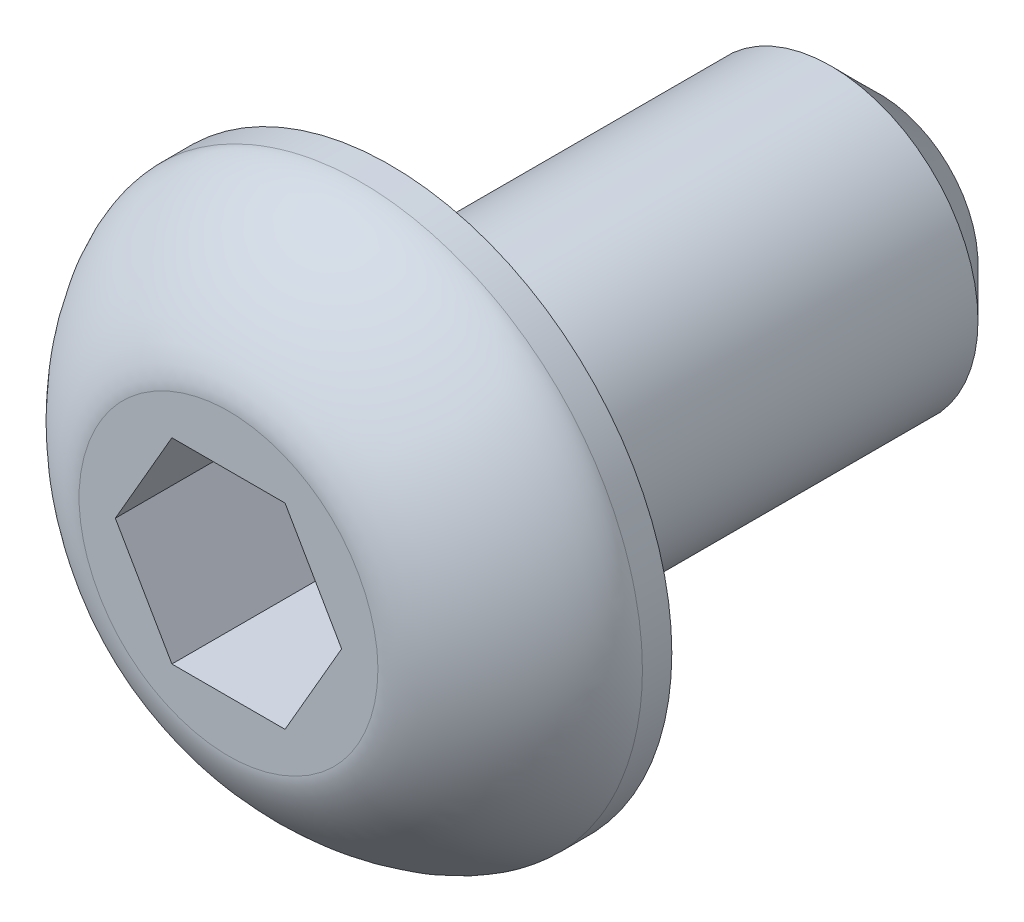
ISO-10303-21;
HEADER;
FILE_DESCRIPTION(('STEP AP214'),'2;1');
FILE_NAME('part.step','',(''),(''),'','','');
FILE_SCHEMA(('AUTOMOTIVE_DESIGN { 1 0 10303 214 1 1 1 1 }'));
ENDSEC;
DATA;
#1=APPLICATION_CONTEXT('core data for automotive mechanical design processes');
#2=APPLICATION_PROTOCOL_DEFINITION('international standard','automotive_design',2000,#1);
#3=PRODUCT_CONTEXT('',#1,'mechanical');
#4=PRODUCT('Part','Part','',(#3));
#5=PRODUCT_RELATED_PRODUCT_CATEGORY('part','',(#4));
#6=PRODUCT_DEFINITION_FORMATION('','',#4);
#7=PRODUCT_DEFINITION_CONTEXT('part definition',#1,'design');
#8=PRODUCT_DEFINITION('design','',#6,#7);
#9=PRODUCT_DEFINITION_SHAPE('','',#8);
#10=(LENGTH_UNIT() NAMED_UNIT(*) SI_UNIT(.MILLI.,.METRE.));
#11=(NAMED_UNIT(*) PLANE_ANGLE_UNIT() SI_UNIT($,.RADIAN.));
#12=(NAMED_UNIT(*) SI_UNIT($,.STERADIAN.) SOLID_ANGLE_UNIT());
#13=UNCERTAINTY_MEASURE_WITH_UNIT(LENGTH_MEASURE(1.E-05),#10,'distance_accuracy_value','');
#14=(GEOMETRIC_REPRESENTATION_CONTEXT(3) GLOBAL_UNCERTAINTY_ASSIGNED_CONTEXT((#13)) GLOBAL_UNIT_ASSIGNED_CONTEXT((#10,
#11,#12)) REPRESENTATION_CONTEXT('',''));
#15=CARTESIAN_POINT('',(0.,0.,0.));
#16=DIRECTION('',(0.,0.,1.));
#17=DIRECTION('',(1.,0.,0.));
#18=AXIS2_PLACEMENT_3D('',#15,#16,#17);
#19=CARTESIAN_POINT('',(0.,0.,1.65));
#20=DIRECTION('',(0.,0.,1.));
#21=DIRECTION('',(1.,0.,0.));
#22=AXIS2_PLACEMENT_3D('',#19,#20,#21);
#23=PLANE('',#22);
#24=CARTESIAN_POINT('',(1.525,0.,1.65));
#25=CARTESIAN_POINT('',(1.525,-0.399244037781713,1.65));
#26=CARTESIAN_POINT('',(1.36064600777329,-0.796029674845719,1.65));
#27=CARTESIAN_POINT('',(0.79602967484567,-1.36064600777326,1.65));
#28=CARTESIAN_POINT('',(0.399244037781751,-1.525,1.65));
#29=CARTESIAN_POINT('',(-0.399244037781746,-1.525,1.65));
#30=CARTESIAN_POINT('',(-0.79602967484569,-1.36064600777324,1.65));
#31=CARTESIAN_POINT('',(-1.36064600777328,-0.796029674845735,1.65));
#32=CARTESIAN_POINT('',(-1.525,-0.399244037781749,1.65));
#33=CARTESIAN_POINT('',(-1.525,0.399244037781749,1.65));
#34=CARTESIAN_POINT('',(-1.36064600777328,0.79602967484569,1.65));
#35=CARTESIAN_POINT('',(-0.796029674845692,1.36064600777328,1.65));
#36=CARTESIAN_POINT('',(-0.399244037781749,1.525,1.65));
#37=CARTESIAN_POINT('',(0.399244037781749,1.525,1.65));
#38=CARTESIAN_POINT('',(0.79602967484573,1.36064600777328,1.65));
#39=CARTESIAN_POINT('',(1.36064600777324,0.796029674845687,1.65));
#40=CARTESIAN_POINT('',(1.525,0.399244037781713,1.65));
#41=CARTESIAN_POINT('',(1.525,0.,1.65));
#42=(BOUNDED_CURVE() B_SPLINE_CURVE(3,(#24,#25,#26,#27,#28,#29,#30,#31,#32,#33,#34,#35,#36,#37,
#38,#39,#40,#41),.UNSPECIFIED.,.T.,.F.) B_SPLINE_CURVE_WITH_KNOTS((4,2,2,2,2,2,2,2,4),(0.,
0.785398163397451,1.5707963267949,2.35619449019235,3.1415926535898,3.92699081698725,
4.7123889803847,5.49778714378214,6.28318530717959),
.UNSPECIFIED.) CURVE() GEOMETRIC_REPRESENTATION_ITEM() RATIONAL_B_SPLINE_CURVE((1.,1.,1.,1.,1.,
1.,1.,1.,1.,1.,1.,1.,1.,1.,1.,1.,1.,1.)) REPRESENTATION_ITEM(''));
#43=CARTESIAN_POINT('',(1.525,0.,1.65));
#44=VERTEX_POINT('',#43);
#45=EDGE_CURVE('E153',#44,#44,#42,.F.);
#46=ORIENTED_EDGE('',*,*,#45,.T.);
#47=EDGE_LOOP('',(#46));
#48=FACE_BOUND('',#47,.T.);
#49=DIRECTION('',(1.,0.,0.));
#50=VECTOR('',#49,1.);
#51=CARTESIAN_POINT('',(0.0995927494460478,1.,1.65));
#52=LINE('',#51,#50);
#53=CARTESIAN_POINT('',(-0.577350269189625,1.,1.65));
#54=VERTEX_POINT('',#53);
#55=CARTESIAN_POINT('',(0.577350269189627,1.,1.65));
#56=VERTEX_POINT('',#55);
#57=EDGE_CURVE('E132',#54,#56,#52,.T.);
#58=ORIENTED_EDGE('',*,*,#57,.T.);
#59=DIRECTION('',(0.5,-0.866025403784439,0.));
#60=VECTOR('',#59,1.);
#61=CARTESIAN_POINT('',(0.915821778507463,0.413750148946983,1.65));
#62=LINE('',#61,#60);
#63=CARTESIAN_POINT('',(1.15470053837925,0.,1.65));
#64=VERTEX_POINT('',#63);
#65=EDGE_CURVE('E129',#56,#64,#62,.T.);
#66=ORIENTED_EDGE('',*,*,#65,.T.);
#67=DIRECTION('',(-0.5,-0.866025403784438,0.));
#68=VECTOR('',#67,1.);
#69=CARTESIAN_POINT('',(0.816229029061414,-0.586249851053017,1.65));
#70=LINE('',#69,#68);
#71=CARTESIAN_POINT('',(0.577350269189625,-1.,1.65));
#72=VERTEX_POINT('',#71);
#73=EDGE_CURVE('E140',#64,#72,#70,.T.);
#74=ORIENTED_EDGE('',*,*,#73,.T.);
#75=DIRECTION('',(-1.,0.,0.));
#76=VECTOR('',#75,1.);
#77=CARTESIAN_POINT('',(-0.0995927494460486,-1.,1.65));
#78=LINE('',#77,#76);
#79=CARTESIAN_POINT('',(-0.577350269189626,-1.,1.65));
#80=VERTEX_POINT('',#79);
#81=EDGE_CURVE('E59',#72,#80,#78,.T.);
#82=ORIENTED_EDGE('',*,*,#81,.T.);
#83=DIRECTION('',(-0.5,0.866025403784439,0.));
#84=VECTOR('',#83,1.);
#85=CARTESIAN_POINT('',(-0.866025403784439,-0.5,1.65));
#86=LINE('',#85,#84);
#87=CARTESIAN_POINT('',(-1.15470053837925,0.,1.65));
#88=VERTEX_POINT('',#87);
#89=EDGE_CURVE('E108',#80,#88,#86,.T.);
#90=ORIENTED_EDGE('',*,*,#89,.T.);
#91=DIRECTION('',(0.5,0.866025403784439,0.));
#92=VECTOR('',#91,1.);
#93=CARTESIAN_POINT('',(-0.816229029061414,0.586249851053016,1.65));
#94=LINE('',#93,#92);
#95=EDGE_CURVE('E135',#88,#54,#94,.T.);
#96=ORIENTED_EDGE('',*,*,#95,.T.);
#97=EDGE_LOOP('',(#58,#66,#74,#82,#90,#96));
#98=FACE_BOUND('',#97,.T.);
#99=ADVANCED_FACE('F44',(#48,#98),#23,.T.);
#100=CARTESIAN_POINT('',(0.,0.,1.65));
#101=DIRECTION('',(0.,0.,-1.));
#102=DIRECTION('',(-1.,0.,0.));
#103=AXIS2_PLACEMENT_3D('',#100,#101,#102);
#104=CYLINDRICAL_SURFACE('',#103,2.875);
#105=CARTESIAN_POINT('',(2.875,0.,0.3));
#106=CARTESIAN_POINT('',(2.875,0.752673185981918,0.3));
#107=CARTESIAN_POINT('',(2.56515230973648,1.50071168208618,0.3));
#108=CARTESIAN_POINT('',(1.50071168208618,2.56515230973648,0.3));
#109=CARTESIAN_POINT('',(0.752673185981985,2.875,0.3));
#110=CARTESIAN_POINT('',(-0.752673185981985,2.875,0.3));
#111=CARTESIAN_POINT('',(-1.50071168208614,2.56515230973651,0.3));
#112=CARTESIAN_POINT('',(-2.56515230973651,1.50071168208614,0.3));
#113=CARTESIAN_POINT('',(-2.875,0.752673185981986,0.3));
#114=CARTESIAN_POINT('',(-2.875,-0.752673185981985,0.3));
#115=CARTESIAN_POINT('',(-2.56515230973647,-1.50071168208618,0.3));
#116=CARTESIAN_POINT('',(-1.50071168208618,-2.56515230973647,0.3));
#117=CARTESIAN_POINT('',(-0.752673185981981,-2.875,0.3));
#118=CARTESIAN_POINT('',(0.75267318598199,-2.875,0.3));
#119=CARTESIAN_POINT('',(1.50071168208611,-2.56515230973653,0.3));
#120=CARTESIAN_POINT('',(2.56515230973652,-1.50071168208613,0.3));
#121=CARTESIAN_POINT('',(2.875,-0.752673185981918,0.3));
#122=CARTESIAN_POINT('',(2.875,0.,0.3));
#123=(BOUNDED_CURVE() B_SPLINE_CURVE(3,(#105,#106,#107,#108,#109,#110,#111,#112,#113,#114,#115,
#116,#117,#118,#119,#120,#121,#122),.UNSPECIFIED.,.T.,.F.) B_SPLINE_CURVE_WITH_KNOTS((4,2,2,2,2,
2,2,2,4),(0.,0.785398163397448,1.5707963267949,2.35619449019234,3.1415926535898,
3.92699081698724,4.71238898038469,5.49778714378214,6.28318530717959),
.UNSPECIFIED.) CURVE() GEOMETRIC_REPRESENTATION_ITEM() RATIONAL_B_SPLINE_CURVE((1.,1.,1.,1.,1.,
1.,1.,1.,1.,1.,1.,1.,1.,1.,1.,1.,1.,1.)) REPRESENTATION_ITEM(''));
#124=CARTESIAN_POINT('',(2.875,0.,0.3));
#125=VERTEX_POINT('',#124);
#126=EDGE_CURVE('E210',#125,#125,#123,.F.);
#127=ORIENTED_EDGE('',*,*,#126,.T.);
#128=EDGE_LOOP('',(#127));
#129=FACE_BOUND('',#128,.T.);
#130=CARTESIAN_POINT('',(0.,0.,0.));
#131=DIRECTION('',(0.,0.,1.));
#132=DIRECTION('',(1.,0.,0.));
#133=AXIS2_PLACEMENT_3D('',#130,#131,#132);
#134=CIRCLE('',#133,2.875);
#135=CARTESIAN_POINT('',(2.875,0.,0.));
#136=VERTEX_POINT('',#135);
#137=EDGE_CURVE('E150',#136,#136,#134,.T.);
#138=ORIENTED_EDGE('',*,*,#137,.T.);
#139=EDGE_LOOP('',(#138));
#140=FACE_BOUND('',#139,.T.);
#141=ADVANCED_FACE('F173',(#129,#140),#104,.T.);
#142=CARTESIAN_POINT('',(0.,0.,0.));
#143=DIRECTION('',(0.,0.,1.));
#144=DIRECTION('',(1.,0.,0.));
#145=AXIS2_PLACEMENT_3D('',#142,#143,#144);
#146=PLANE('',#145);
#147=CARTESIAN_POINT('',(0.,0.,0.));
#148=DIRECTION('',(0.,0.,-1.));
#149=DIRECTION('',(1.,0.,0.));
#150=AXIS2_PLACEMENT_3D('',#147,#148,#149);
#151=CIRCLE('',#150,1.5);
#152=CARTESIAN_POINT('',(1.5,0.,0.));
#153=VERTEX_POINT('',#152);
#154=EDGE_CURVE('E219',#153,#153,#151,.T.);
#155=ORIENTED_EDGE('',*,*,#154,.F.);
#156=EDGE_LOOP('',(#155));
#157=FACE_BOUND('',#156,.T.);
#158=ORIENTED_EDGE('',*,*,#137,.F.);
#159=EDGE_LOOP('',(#158));
#160=FACE_BOUND('',#159,.T.);
#161=ADVANCED_FACE('F176',(#157,#160),#146,.F.);
#162=CARTESIAN_POINT('',(0.915821778507463,0.413750148946983,0.15));
#163=DIRECTION('',(-0.866025403784439,-0.5,0.));
#164=DIRECTION('',(0.5,-0.866025403784439,0.));
#165=AXIS2_PLACEMENT_3D('',#162,#163,#164);
#166=PLANE('',#165);
#167=ORIENTED_EDGE('',*,*,#65,.F.);
#168=DIRECTION('',(0.,0.,1.));
#169=VECTOR('',#168,1.);
#170=CARTESIAN_POINT('',(0.577350269189627,1.,0.15));
#171=LINE('',#170,#169);
#172=CARTESIAN_POINT('',(0.577350269189627,1.,0.15));
#173=VERTEX_POINT('',#172);
#174=EDGE_CURVE('E92',#173,#56,#171,.T.);
#175=ORIENTED_EDGE('',*,*,#174,.F.);
#176=DIRECTION('',(0.5,-0.866025403784439,0.));
#177=VECTOR('',#176,1.);
#178=CARTESIAN_POINT('',(0.915821778507463,0.413750148946983,0.15));
#179=LINE('',#178,#177);
#180=CARTESIAN_POINT('',(1.15470053837925,0.,0.15));
#181=VERTEX_POINT('',#180);
#182=EDGE_CURVE('E143',#173,#181,#179,.T.);
#183=ORIENTED_EDGE('',*,*,#182,.T.);
#184=DIRECTION('',(0.,0.,1.));
#185=VECTOR('',#184,1.);
#186=CARTESIAN_POINT('',(1.15470053837925,0.,0.15));
#187=LINE('',#186,#185);
#188=EDGE_CURVE('E68',#181,#64,#187,.T.);
#189=ORIENTED_EDGE('',*,*,#188,.T.);
#190=EDGE_LOOP('',(#167,#175,#183,#189));
#191=FACE_BOUND('',#190,.T.);
#192=ADVANCED_FACE('F174',(#191),#166,.T.);
#193=CARTESIAN_POINT('',(0.0995927494460478,1.,0.15));
#194=DIRECTION('',(0.,-1.,0.));
#195=DIRECTION('',(1.,0.,0.));
#196=AXIS2_PLACEMENT_3D('',#193,#194,#195);
#197=PLANE('',#196);
#198=ORIENTED_EDGE('',*,*,#57,.F.);
#199=DIRECTION('',(0.,0.,1.));
#200=VECTOR('',#199,1.);
#201=CARTESIAN_POINT('',(-0.577350269189625,1.,0.15));
#202=LINE('',#201,#200);
#203=CARTESIAN_POINT('',(-0.577350269189625,1.,0.15));
#204=VERTEX_POINT('',#203);
#205=EDGE_CURVE('E147',#204,#54,#202,.T.);
#206=ORIENTED_EDGE('',*,*,#205,.F.);
#207=DIRECTION('',(1.,0.,0.));
#208=VECTOR('',#207,1.);
#209=CARTESIAN_POINT('',(0.0995927494460478,1.,0.15));
#210=LINE('',#209,#208);
#211=EDGE_CURVE('E228',#204,#173,#210,.T.);
#212=ORIENTED_EDGE('',*,*,#211,.T.);
#213=ORIENTED_EDGE('',*,*,#174,.T.);
#214=EDGE_LOOP('',(#198,#206,#212,#213));
#215=FACE_BOUND('',#214,.T.);
#216=ADVANCED_FACE('F236',(#215),#197,.T.);
#217=CARTESIAN_POINT('',(-0.816229029061414,0.586249851053016,0.15));
#218=DIRECTION('',(0.866025403784438,-0.5,0.));
#219=DIRECTION('',(0.5,0.866025403784439,0.));
#220=AXIS2_PLACEMENT_3D('',#217,#218,#219);
#221=PLANE('',#220);
#222=ORIENTED_EDGE('',*,*,#95,.F.);
#223=DIRECTION('',(0.,0.,1.));
#224=VECTOR('',#223,1.);
#225=CARTESIAN_POINT('',(-1.15470053837925,0.,0.15));
#226=LINE('',#225,#224);
#227=CARTESIAN_POINT('',(-1.15470053837925,0.,0.15));
#228=VERTEX_POINT('',#227);
#229=EDGE_CURVE('E110',#228,#88,#226,.T.);
#230=ORIENTED_EDGE('',*,*,#229,.F.);
#231=DIRECTION('',(0.5,0.866025403784439,0.));
#232=VECTOR('',#231,1.);
#233=CARTESIAN_POINT('',(-0.816229029061414,0.586249851053016,0.15));
#234=LINE('',#233,#232);
#235=EDGE_CURVE('E121',#228,#204,#234,.T.);
#236=ORIENTED_EDGE('',*,*,#235,.T.);
#237=ORIENTED_EDGE('',*,*,#205,.T.);
#238=EDGE_LOOP('',(#222,#230,#236,#237));
#239=FACE_BOUND('',#238,.T.);
#240=ADVANCED_FACE('F231',(#239),#221,.T.);
#241=CARTESIAN_POINT('',(-0.866025403784439,-0.5,0.15));
#242=DIRECTION('',(0.866025403784439,0.5,0.));
#243=DIRECTION('',(-0.5,0.866025403784439,0.));
#244=AXIS2_PLACEMENT_3D('',#241,#242,#243);
#245=PLANE('',#244);
#246=ORIENTED_EDGE('',*,*,#89,.F.);
#247=DIRECTION('',(0.,0.,1.));
#248=VECTOR('',#247,1.);
#249=CARTESIAN_POINT('',(-0.577350269189626,-1.,0.15));
#250=LINE('',#249,#248);
#251=CARTESIAN_POINT('',(-0.577350269189626,-1.,0.15));
#252=VERTEX_POINT('',#251);
#253=EDGE_CURVE('E103',#252,#80,#250,.T.);
#254=ORIENTED_EDGE('',*,*,#253,.F.);
#255=DIRECTION('',(-0.5,0.866025403784439,0.));
#256=VECTOR('',#255,1.);
#257=CARTESIAN_POINT('',(-0.866025403784439,-0.5,0.15));
#258=LINE('',#257,#256);
#259=EDGE_CURVE('E106',#252,#228,#258,.T.);
#260=ORIENTED_EDGE('',*,*,#259,.T.);
#261=ORIENTED_EDGE('',*,*,#229,.T.);
#262=EDGE_LOOP('',(#246,#254,#260,#261));
#263=FACE_BOUND('',#262,.T.);
#264=ADVANCED_FACE('F105',(#263),#245,.T.);
#265=CARTESIAN_POINT('',(-0.0995927494460486,-1.,0.15));
#266=DIRECTION('',(0.,1.,0.));
#267=DIRECTION('',(-1.,0.,0.));
#268=AXIS2_PLACEMENT_3D('',#265,#266,#267);
#269=PLANE('',#268);
#270=ORIENTED_EDGE('',*,*,#81,.F.);
#271=DIRECTION('',(0.,0.,1.));
#272=VECTOR('',#271,1.);
#273=CARTESIAN_POINT('',(0.577350269189625,-1.,0.15));
#274=LINE('',#273,#272);
#275=CARTESIAN_POINT('',(0.577350269189625,-1.,0.15));
#276=VERTEX_POINT('',#275);
#277=EDGE_CURVE('E111',#276,#72,#274,.T.);
#278=ORIENTED_EDGE('',*,*,#277,.F.);
#279=DIRECTION('',(-1.,0.,0.));
#280=VECTOR('',#279,1.);
#281=CARTESIAN_POINT('',(-0.0995927494460486,-1.,0.15));
#282=LINE('',#281,#280);
#283=EDGE_CURVE('E118',#276,#252,#282,.T.);
#284=ORIENTED_EDGE('',*,*,#283,.T.);
#285=ORIENTED_EDGE('',*,*,#253,.T.);
#286=EDGE_LOOP('',(#270,#278,#284,#285));
#287=FACE_BOUND('',#286,.T.);
#288=ADVANCED_FACE('F123',(#287),#269,.T.);
#289=CARTESIAN_POINT('',(0.816229029061414,-0.586249851053017,0.15));
#290=DIRECTION('',(-0.866025403784438,0.5,0.));
#291=DIRECTION('',(-0.5,-0.866025403784438,0.));
#292=AXIS2_PLACEMENT_3D('',#289,#290,#291);
#293=PLANE('',#292);
#294=ORIENTED_EDGE('',*,*,#73,.F.);
#295=ORIENTED_EDGE('',*,*,#188,.F.);
#296=DIRECTION('',(-0.5,-0.866025403784438,0.));
#297=VECTOR('',#296,1.);
#298=CARTESIAN_POINT('',(0.816229029061414,-0.586249851053017,0.15));
#299=LINE('',#298,#297);
#300=EDGE_CURVE('E124',#181,#276,#299,.T.);
#301=ORIENTED_EDGE('',*,*,#300,.T.);
#302=ORIENTED_EDGE('',*,*,#277,.T.);
#303=EDGE_LOOP('',(#294,#295,#301,#302));
#304=FACE_BOUND('',#303,.T.);
#305=ADVANCED_FACE('F234',(#304),#293,.T.);
#306=CARTESIAN_POINT('',(0.,0.,0.15));
#307=DIRECTION('',(0.,0.,1.));
#308=DIRECTION('',(1.,0.,0.));
#309=AXIS2_PLACEMENT_3D('',#306,#307,#308);
#310=PLANE('',#309);
#311=ORIENTED_EDGE('',*,*,#182,.F.);
#312=ORIENTED_EDGE('',*,*,#211,.F.);
#313=ORIENTED_EDGE('',*,*,#235,.F.);
#314=ORIENTED_EDGE('',*,*,#259,.F.);
#315=ORIENTED_EDGE('',*,*,#283,.F.);
#316=ORIENTED_EDGE('',*,*,#300,.F.);
#317=EDGE_LOOP('',(#311,#312,#313,#314,#315,#316));
#318=FACE_BOUND('',#317,.T.);
#319=ADVANCED_FACE('F117',(#318),#310,.T.);
#320=CARTESIAN_POINT('',(1.525,0.,1.65));
#321=CARTESIAN_POINT('',(1.525,0.399244037781713,1.65));
#322=CARTESIAN_POINT('',(1.36064600777324,0.796029674845687,1.65));
#323=CARTESIAN_POINT('',(0.79602967484573,1.36064600777328,1.65));
#324=CARTESIAN_POINT('',(0.399244037781749,1.525,1.65));
#325=CARTESIAN_POINT('',(-0.399244037781749,1.525,1.65));
#326=CARTESIAN_POINT('',(-0.796029674845692,1.36064600777328,1.65));
#327=CARTESIAN_POINT('',(-1.36064600777328,0.79602967484569,1.65));
#328=CARTESIAN_POINT('',(-1.525,0.399244037781749,1.65));
#329=CARTESIAN_POINT('',(-1.525,-0.399244037781749,1.65));
#330=CARTESIAN_POINT('',(-1.36064600777328,-0.796029674845735,1.65));
#331=CARTESIAN_POINT('',(-0.79602967484569,-1.36064600777324,1.65));
#332=CARTESIAN_POINT('',(-0.399244037781746,-1.525,1.65));
#333=CARTESIAN_POINT('',(0.399244037781751,-1.525,1.65));
#334=CARTESIAN_POINT('',(0.79602967484567,-1.36064600777326,1.65));
#335=CARTESIAN_POINT('',(1.36064600777329,-0.796029674845719,1.65));
#336=CARTESIAN_POINT('',(1.525,-0.399244037781713,1.65));
#337=CARTESIAN_POINT('',(1.525,0.,1.65));
#338=CARTESIAN_POINT('',(2.875,0.,1.65));
#339=CARTESIAN_POINT('',(2.87499999999983,0.752673185981917,1.64999999999987));
#340=CARTESIAN_POINT('',(2.56515230973643,1.50071168208613,1.65));
#341=CARTESIAN_POINT('',(1.50071168208622,2.56515230973651,1.65));
#342=CARTESIAN_POINT('',(0.752673185981985,2.875,1.65));
#343=CARTESIAN_POINT('',(-0.752673185981985,2.875,1.65));
#344=CARTESIAN_POINT('',(-1.50071168208614,2.56515230973651,1.65));
#345=CARTESIAN_POINT('',(-2.56515230973651,1.50071168208613,1.65));
#346=CARTESIAN_POINT('',(-2.875,0.752673185981985,1.65));
#347=CARTESIAN_POINT('',(-2.875,-0.752673185981985,1.65));
#348=CARTESIAN_POINT('',(-2.56515230973651,-1.50071168208622,1.65));
#349=CARTESIAN_POINT('',(-1.50071168208613,-2.56515230973643,1.65));
#350=CARTESIAN_POINT('',(-0.75267318598198,-2.875,1.65));
#351=CARTESIAN_POINT('',(0.752673185981989,-2.875,1.65));
#352=CARTESIAN_POINT('',(1.50071168208612,-2.56515230973653,1.64999999999995));
#353=CARTESIAN_POINT('',(2.56515230973652,-1.50071168208613,1.65000000000004));
#354=CARTESIAN_POINT('',(2.87500000000017,-0.752673185981917,1.65000000000013));
#355=CARTESIAN_POINT('',(2.875,0.,1.65));
#356=CARTESIAN_POINT('',(2.875,0.,0.3));
#357=CARTESIAN_POINT('',(2.875,0.752673185981918,0.3));
#358=CARTESIAN_POINT('',(2.56515230973648,1.50071168208618,0.3));
#359=CARTESIAN_POINT('',(1.50071168208618,2.56515230973648,0.3));
#360=CARTESIAN_POINT('',(0.752673185981985,2.875,0.3));
#361=CARTESIAN_POINT('',(-0.752673185981985,2.875,0.3));
#362=CARTESIAN_POINT('',(-1.50071168208614,2.56515230973651,0.3));
#363=CARTESIAN_POINT('',(-2.56515230973651,1.50071168208614,0.3));
#364=CARTESIAN_POINT('',(-2.875,0.752673185981986,0.3));
#365=CARTESIAN_POINT('',(-2.875,-0.752673185981985,0.3));
#366=CARTESIAN_POINT('',(-2.56515230973647,-1.50071168208618,0.3));
#367=CARTESIAN_POINT('',(-1.50071168208618,-2.56515230973647,0.3));
#368=CARTESIAN_POINT('',(-0.752673185981981,-2.875,0.3));
#369=CARTESIAN_POINT('',(0.75267318598199,-2.875,0.3));
#370=CARTESIAN_POINT('',(1.50071168208611,-2.56515230973653,0.3));
#371=CARTESIAN_POINT('',(2.56515230973652,-1.50071168208613,0.3));
#372=CARTESIAN_POINT('',(2.875,-0.752673185981918,0.3));
#373=CARTESIAN_POINT('',(2.875,0.,0.3));
#374=(BOUNDED_SURFACE() B_SPLINE_SURFACE(2,3,((#320,#321,#322,#323,#324,#325,#326,#327,#328,
#329,#330,#331,#332,#333,#334,#335,#336,#337),(#338,#339,#340,#341,#342,#343,#344,#345,#346,
#347,#348,#349,#350,#351,#352,#353,#354,#355),(#356,#357,#358,#359,#360,#361,#362,#363,#364,
#365,#366,#367,#368,#369,#370,#371,#372,#373)),.UNSPECIFIED.,.F.,.T.,
.F.) B_SPLINE_SURFACE_WITH_KNOTS((3,3),(4,2,2,2,2,2,2,2,4),(0.,1.),(0.,0.785398163397448,
1.5707963267949,2.35619449019234,3.1415926535898,3.92699081698724,4.71238898038469,
5.49778714378214,6.28318530717959),
.UNSPECIFIED.) GEOMETRIC_REPRESENTATION_ITEM() RATIONAL_B_SPLINE_SURFACE(((1.,1.,1.,1.,1.,1.,1.,
1.,1.,1.,1.,1.,1.,1.,1.,1.,1.,1.),(0.333333333333334,0.333333333333334,0.333333333333334,
0.333333333333334,0.333333333333334,0.333333333333334,0.333333333333334,0.333333333333334,
0.333333333333334,0.333333333333334,0.333333333333334,0.333333333333334,0.333333333333334,
0.333333333333334,0.333333333333334,0.333333333333334,0.333333333333334,0.333333333333334),(1.,
1.,1.,1.,1.,1.,1.,1.,1.,1.,1.,1.,1.,1.,1.,1.,1.,1.))) REPRESENTATION_ITEM('') SURFACE());
#375=ORIENTED_EDGE('',*,*,#126,.F.);
#376=EDGE_LOOP('',(#375));
#377=FACE_BOUND('',#376,.T.);
#378=ORIENTED_EDGE('',*,*,#45,.F.);
#379=EDGE_LOOP('',(#378));
#380=FACE_BOUND('',#379,.T.);
#381=ADVANCED_FACE('F185',(#377,#380),#374,.T.);
#382=CARTESIAN_POINT('',(0.,0.,-12.));
#383=DIRECTION('',(0.,0.,1.));
#384=DIRECTION('',(1.,0.,0.));
#385=AXIS2_PLACEMENT_3D('',#382,#383,#384);
#386=CYLINDRICAL_SURFACE('',#385,1.5);
#387=CARTESIAN_POINT('',(0.,0.,-4.5));
#388=DIRECTION('',(0.,0.,-1.));
#389=DIRECTION('',(-1.,0.,0.));
#390=AXIS2_PLACEMENT_3D('',#387,#388,#389);
#391=CIRCLE('',#390,1.5);
#392=CARTESIAN_POINT('',(-1.5,0.,-4.5));
#393=VERTEX_POINT('',#392);
#394=EDGE_CURVE('E12',#393,#393,#391,.F.);
#395=ORIENTED_EDGE('',*,*,#394,.T.);
#396=EDGE_LOOP('',(#395));
#397=FACE_BOUND('',#396,.T.);
#398=ORIENTED_EDGE('',*,*,#154,.T.);
#399=EDGE_LOOP('',(#398));
#400=FACE_BOUND('',#399,.T.);
#401=ADVANCED_FACE('F254',(#397,#400),#386,.T.);
#402=CARTESIAN_POINT('',(0.,0.,-5.));
#403=DIRECTION('',(0.,0.,-1.));
#404=DIRECTION('',(1.,0.,0.));
#405=AXIS2_PLACEMENT_3D('',#402,#403,#404);
#406=PLANE('',#405);
#407=CARTESIAN_POINT('',(0.,0.,-5.));
#408=DIRECTION('',(0.,0.,-1.));
#409=DIRECTION('',(-1.,0.,0.));
#410=AXIS2_PLACEMENT_3D('',#407,#408,#409);
#411=CIRCLE('',#410,1.);
#412=CARTESIAN_POINT('',(-1.,0.,-5.));
#413=VERTEX_POINT('',#412);
#414=EDGE_CURVE('E52',#413,#413,#411,.T.);
#415=ORIENTED_EDGE('',*,*,#414,.T.);
#416=EDGE_LOOP('',(#415));
#417=FACE_BOUND('',#416,.T.);
#418=ADVANCED_FACE('F256',(#417),#406,.T.);
#419=CARTESIAN_POINT('',(0.,0.,-5.));
#420=DIRECTION('',(0.,0.,1.));
#421=DIRECTION('',(1.,0.,0.));
#422=AXIS2_PLACEMENT_3D('',#419,#420,#421);
#423=CONICAL_SURFACE('',#422,1.,0.785398163397448);
#424=ORIENTED_EDGE('',*,*,#394,.F.);
#425=EDGE_LOOP('',(#424));
#426=FACE_BOUND('',#425,.T.);
#427=ORIENTED_EDGE('',*,*,#414,.F.);
#428=EDGE_LOOP('',(#427));
#429=FACE_BOUND('',#428,.T.);
#430=ADVANCED_FACE('F46',(#426,#429),#423,.T.);
#431=CLOSED_SHELL('',(#99,#141,#161,#192,#216,#240,#264,#288,#305,#319,#381,#401,#418,#430));
#432=MANIFOLD_SOLID_BREP('B2',#431);
#433=ADVANCED_BREP_SHAPE_REPRESENTATION('',(#18,#432),#14);
#434=SHAPE_DEFINITION_REPRESENTATION(#9,#433);
ENDSEC;
END-ISO-10303-21;
